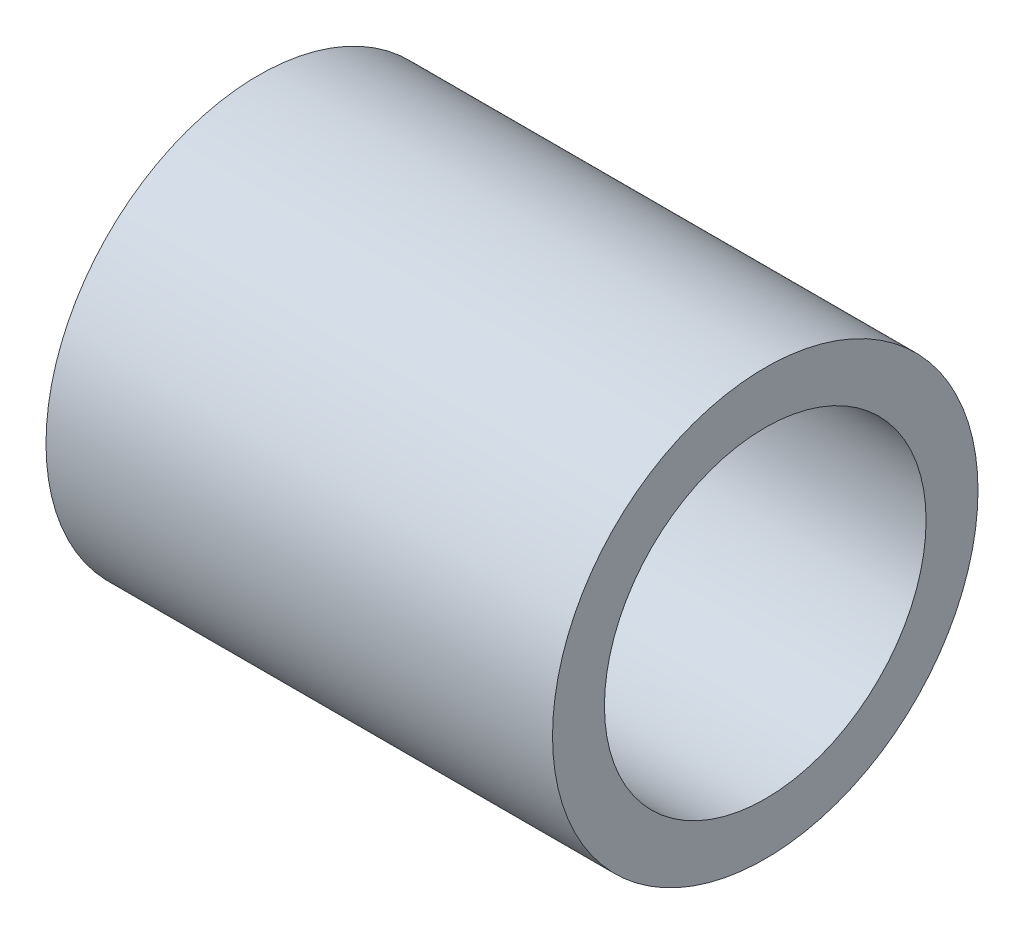
ISO-10303-21;
HEADER;
FILE_DESCRIPTION(('STEP AP214'),'2;1');
FILE_NAME('part.step','',(''),(''),'','','');
FILE_SCHEMA(('AUTOMOTIVE_DESIGN { 1 0 10303 214 1 1 1 1 }'));
ENDSEC;
DATA;
#1=APPLICATION_CONTEXT('core data for automotive mechanical design processes');
#2=APPLICATION_PROTOCOL_DEFINITION('international standard','automotive_design',2000,#1);
#3=PRODUCT_CONTEXT('',#1,'mechanical');
#4=PRODUCT('Part','Part','',(#3));
#5=PRODUCT_RELATED_PRODUCT_CATEGORY('part','',(#4));
#6=PRODUCT_DEFINITION_FORMATION('','',#4);
#7=PRODUCT_DEFINITION_CONTEXT('part definition',#1,'design');
#8=PRODUCT_DEFINITION('design','',#6,#7);
#9=PRODUCT_DEFINITION_SHAPE('','',#8);
#10=(LENGTH_UNIT() NAMED_UNIT(*) SI_UNIT(.MILLI.,.METRE.));
#11=(NAMED_UNIT(*) PLANE_ANGLE_UNIT() SI_UNIT($,.RADIAN.));
#12=(NAMED_UNIT(*) SI_UNIT($,.STERADIAN.) SOLID_ANGLE_UNIT());
#13=UNCERTAINTY_MEASURE_WITH_UNIT(LENGTH_MEASURE(1.E-05),#10,'distance_accuracy_value','');
#14=(GEOMETRIC_REPRESENTATION_CONTEXT(3) GLOBAL_UNCERTAINTY_ASSIGNED_CONTEXT((#13)) GLOBAL_UNIT_ASSIGNED_CONTEXT((#10,
#11,#12)) REPRESENTATION_CONTEXT('',''));
#15=CARTESIAN_POINT('',(0.,0.,0.));
#16=DIRECTION('',(0.,0.,1.));
#17=DIRECTION('',(1.,0.,0.));
#18=AXIS2_PLACEMENT_3D('',#15,#16,#17);
#19=CARTESIAN_POINT('',(2.5,0.,0.));
#20=DIRECTION('',(1.,0.,0.));
#21=DIRECTION('',(0.,0.,-1.));
#22=AXIS2_PLACEMENT_3D('',#19,#20,#21);
#23=PLANE('',#22);
#24=CARTESIAN_POINT('',(2.5,0.,0.));
#25=DIRECTION('',(1.,0.,0.));
#26=DIRECTION('',(0.,0.,-1.));
#27=AXIS2_PLACEMENT_3D('',#24,#25,#26);
#28=CIRCLE('',#27,2.1);
#29=CARTESIAN_POINT('',(2.5,0.,-2.1));
#30=VERTEX_POINT('',#29);
#31=EDGE_CURVE('E10',#30,#30,#28,.T.);
#32=ORIENTED_EDGE('',*,*,#31,.T.);
#33=EDGE_LOOP('',(#32));
#34=FACE_BOUND('',#33,.T.);
#35=CARTESIAN_POINT('',(2.5,0.,0.));
#36=DIRECTION('',(1.,0.,0.));
#37=DIRECTION('',(0.,0.,-1.));
#38=AXIS2_PLACEMENT_3D('',#35,#36,#37);
#39=CIRCLE('',#38,1.5875);
#40=CARTESIAN_POINT('',(2.5,0.,-1.5875));
#41=VERTEX_POINT('',#40);
#42=EDGE_CURVE('E44',#41,#41,#39,.T.);
#43=ORIENTED_EDGE('',*,*,#42,.F.);
#44=EDGE_LOOP('',(#43));
#45=FACE_BOUND('',#44,.T.);
#46=ADVANCED_FACE('F33',(#34,#45),#23,.T.);
#47=CARTESIAN_POINT('',(-2.5,0.,0.));
#48=DIRECTION('',(1.,0.,0.));
#49=DIRECTION('',(0.,0.,-1.));
#50=AXIS2_PLACEMENT_3D('',#47,#48,#49);
#51=PLANE('',#50);
#52=CARTESIAN_POINT('',(-2.5,0.,0.));
#53=DIRECTION('',(1.,0.,0.));
#54=DIRECTION('',(0.,0.,-1.));
#55=AXIS2_PLACEMENT_3D('',#52,#53,#54);
#56=CIRCLE('',#55,2.1);
#57=CARTESIAN_POINT('',(-2.5,0.,-2.1));
#58=VERTEX_POINT('',#57);
#59=EDGE_CURVE('E37',#58,#58,#56,.T.);
#60=ORIENTED_EDGE('',*,*,#59,.F.);
#61=EDGE_LOOP('',(#60));
#62=FACE_BOUND('',#61,.T.);
#63=CARTESIAN_POINT('',(-2.5,0.,0.));
#64=DIRECTION('',(1.,0.,0.));
#65=DIRECTION('',(0.,0.,-1.));
#66=AXIS2_PLACEMENT_3D('',#63,#64,#65);
#67=CIRCLE('',#66,1.5875);
#68=CARTESIAN_POINT('',(-2.5,0.,-1.5875));
#69=VERTEX_POINT('',#68);
#70=EDGE_CURVE('E46',#69,#69,#67,.T.);
#71=ORIENTED_EDGE('',*,*,#70,.T.);
#72=EDGE_LOOP('',(#71));
#73=FACE_BOUND('',#72,.T.);
#74=ADVANCED_FACE('F56',(#62,#73),#51,.F.);
#75=CARTESIAN_POINT('',(2.5,0.,0.));
#76=DIRECTION('',(-1.,0.,0.));
#77=DIRECTION('',(0.,0.,1.));
#78=AXIS2_PLACEMENT_3D('',#75,#76,#77);
#79=CYLINDRICAL_SURFACE('',#78,2.1);
#80=ORIENTED_EDGE('',*,*,#31,.F.);
#81=EDGE_LOOP('',(#80));
#82=FACE_BOUND('',#81,.T.);
#83=ORIENTED_EDGE('',*,*,#59,.T.);
#84=EDGE_LOOP('',(#83));
#85=FACE_BOUND('',#84,.T.);
#86=ADVANCED_FACE('F35',(#82,#85),#79,.T.);
#87=CARTESIAN_POINT('',(2.5,0.,0.));
#88=DIRECTION('',(-1.,0.,0.));
#89=DIRECTION('',(0.,0.,1.));
#90=AXIS2_PLACEMENT_3D('',#87,#88,#89);
#91=CYLINDRICAL_SURFACE('',#90,1.5875);
#92=ORIENTED_EDGE('',*,*,#42,.T.);
#93=EDGE_LOOP('',(#92));
#94=FACE_BOUND('',#93,.T.);
#95=ORIENTED_EDGE('',*,*,#70,.F.);
#96=EDGE_LOOP('',(#95));
#97=FACE_BOUND('',#96,.T.);
#98=ADVANCED_FACE('F52',(#94,#97),#91,.F.);
#99=CLOSED_SHELL('',(#46,#74,#86,#98));
#100=MANIFOLD_SOLID_BREP('B2',#99);
#101=ADVANCED_BREP_SHAPE_REPRESENTATION('',(#18,#100),#14);
#102=SHAPE_DEFINITION_REPRESENTATION(#9,#101);
ENDSEC;
END-ISO-10303-21;
